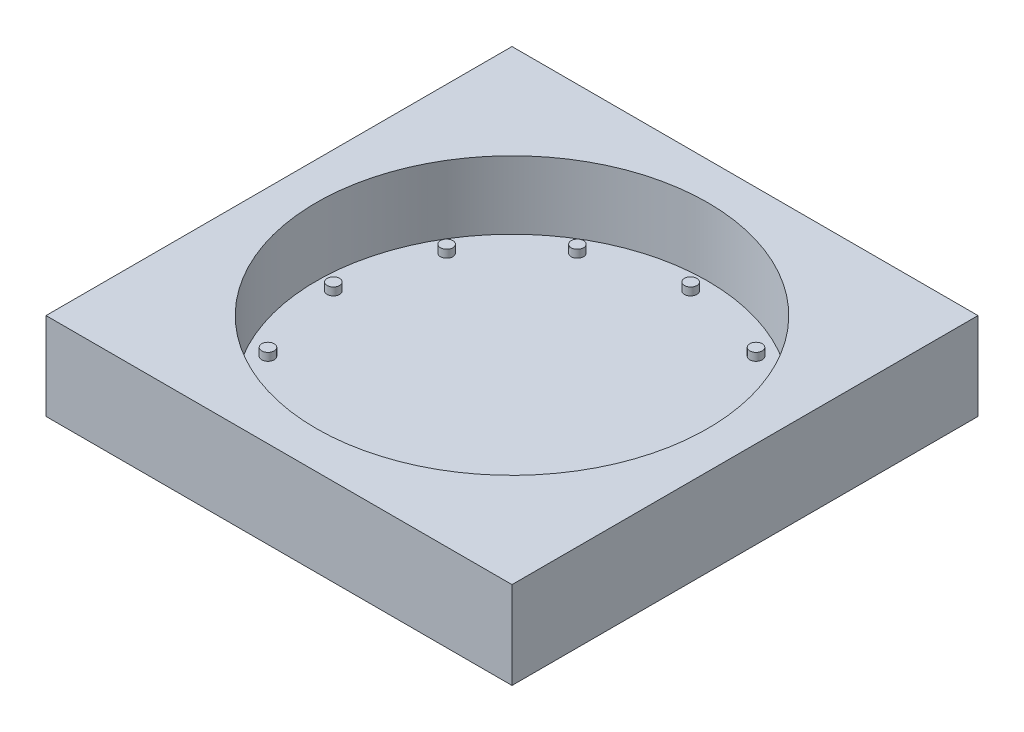
ISO-10303-21;
HEADER;
FILE_DESCRIPTION(('STEP AP214'),'2;1');
FILE_NAME('part.step','',(''),(''),'','','');
FILE_SCHEMA(('AUTOMOTIVE_DESIGN { 1 0 10303 214 1 1 1 1 }'));
ENDSEC;
DATA;
#1=APPLICATION_CONTEXT('core data for automotive mechanical design processes');
#2=APPLICATION_PROTOCOL_DEFINITION('international standard','automotive_design',2000,#1);
#3=PRODUCT_CONTEXT('',#1,'mechanical');
#4=PRODUCT('Part','Part','',(#3));
#5=PRODUCT_RELATED_PRODUCT_CATEGORY('part','',(#4));
#6=PRODUCT_DEFINITION_FORMATION('','',#4);
#7=PRODUCT_DEFINITION_CONTEXT('part definition',#1,'design');
#8=PRODUCT_DEFINITION('design','',#6,#7);
#9=PRODUCT_DEFINITION_SHAPE('','',#8);
#10=(LENGTH_UNIT() NAMED_UNIT(*) SI_UNIT(.MILLI.,.METRE.));
#11=(NAMED_UNIT(*) PLANE_ANGLE_UNIT() SI_UNIT($,.RADIAN.));
#12=(NAMED_UNIT(*) SI_UNIT($,.STERADIAN.) SOLID_ANGLE_UNIT());
#13=UNCERTAINTY_MEASURE_WITH_UNIT(LENGTH_MEASURE(1.E-05),#10,'distance_accuracy_value','');
#14=(GEOMETRIC_REPRESENTATION_CONTEXT(3) GLOBAL_UNCERTAINTY_ASSIGNED_CONTEXT((#13)) GLOBAL_UNIT_ASSIGNED_CONTEXT((#10,
#11,#12)) REPRESENTATION_CONTEXT('',''));
#15=CARTESIAN_POINT('',(0.,0.,0.));
#16=DIRECTION('',(0.,0.,1.));
#17=DIRECTION('',(1.,0.,0.));
#18=AXIS2_PLACEMENT_3D('',#15,#16,#17);
#19=CARTESIAN_POINT('',(0.,22.225,0.));
#20=DIRECTION('',(0.,-1.,0.));
#21=DIRECTION('',(0.,0.,-1.));
#22=AXIS2_PLACEMENT_3D('',#19,#20,#21);
#23=PLANE('',#22);
#24=DIRECTION('',(0.,0.,-1.));
#25=VECTOR('',#24,1.);
#26=CARTESIAN_POINT('',(76.2,22.225,76.2));
#27=LINE('',#26,#25);
#28=CARTESIAN_POINT('',(76.2,22.225,76.2));
#29=VERTEX_POINT('',#28);
#30=CARTESIAN_POINT('',(76.2,22.225,-76.2));
#31=VERTEX_POINT('',#30);
#32=EDGE_CURVE('E123',#29,#31,#27,.T.);
#33=ORIENTED_EDGE('',*,*,#32,.T.);
#34=DIRECTION('',(-1.,0.,0.));
#35=VECTOR('',#34,1.);
#36=CARTESIAN_POINT('',(-76.2,22.225,-76.2));
#37=LINE('',#36,#35);
#38=CARTESIAN_POINT('',(-76.2,22.225,-76.2));
#39=VERTEX_POINT('',#38);
#40=EDGE_CURVE('E129',#31,#39,#37,.T.);
#41=ORIENTED_EDGE('',*,*,#40,.T.);
#42=DIRECTION('',(0.,0.,1.));
#43=VECTOR('',#42,1.);
#44=CARTESIAN_POINT('',(-76.2,22.225,76.2));
#45=LINE('',#44,#43);
#46=CARTESIAN_POINT('',(-76.2,22.225,76.2));
#47=VERTEX_POINT('',#46);
#48=EDGE_CURVE('E60',#39,#47,#45,.T.);
#49=ORIENTED_EDGE('',*,*,#48,.T.);
#50=DIRECTION('',(1.,0.,0.));
#51=VECTOR('',#50,1.);
#52=CARTESIAN_POINT('',(-76.2,22.225,76.2));
#53=LINE('',#52,#51);
#54=EDGE_CURVE('E55',#47,#29,#53,.T.);
#55=ORIENTED_EDGE('',*,*,#54,.T.);
#56=EDGE_LOOP('',(#33,#41,#49,#55));
#57=FACE_BOUND('',#56,.T.);
#58=CARTESIAN_POINT('',(0.,22.225,0.));
#59=DIRECTION('',(0.,1.,0.));
#60=DIRECTION('',(0.,0.,1.));
#61=AXIS2_PLACEMENT_3D('',#58,#59,#60);
#62=CIRCLE('',#61,64.008);
#63=CARTESIAN_POINT('',(0.,22.225,64.008));
#64=VERTEX_POINT('',#63);
#65=EDGE_CURVE('E119',#64,#64,#62,.T.);
#66=ORIENTED_EDGE('',*,*,#65,.F.);
#67=EDGE_LOOP('',(#66));
#68=FACE_BOUND('',#67,.T.);
#69=ADVANCED_FACE('F39',(#57,#68),#23,.F.);
#70=CARTESIAN_POINT('',(76.2,22.225,76.2));
#71=DIRECTION('',(-1.,0.,0.));
#72=DIRECTION('',(0.,0.,1.));
#73=AXIS2_PLACEMENT_3D('',#70,#71,#72);
#74=PLANE('',#73);
#75=DIRECTION('',(0.,-1.,0.));
#76=VECTOR('',#75,1.);
#77=CARTESIAN_POINT('',(76.2,22.225,76.2));
#78=LINE('',#77,#76);
#79=CARTESIAN_POINT('',(76.2,-6.35,76.2));
#80=VERTEX_POINT('',#79);
#81=EDGE_CURVE('E136',#29,#80,#78,.T.);
#82=ORIENTED_EDGE('',*,*,#81,.T.);
#83=DIRECTION('',(0.,0.,1.));
#84=VECTOR('',#83,1.);
#85=CARTESIAN_POINT('',(76.2,-6.35,76.2));
#86=LINE('',#85,#84);
#87=CARTESIAN_POINT('',(76.2,-6.35,-76.2));
#88=VERTEX_POINT('',#87);
#89=EDGE_CURVE('E99',#88,#80,#86,.T.);
#90=ORIENTED_EDGE('',*,*,#89,.F.);
#91=DIRECTION('',(0.,-1.,0.));
#92=VECTOR('',#91,1.);
#93=CARTESIAN_POINT('',(76.2,22.225,-76.2));
#94=LINE('',#93,#92);
#95=EDGE_CURVE('E88',#31,#88,#94,.T.);
#96=ORIENTED_EDGE('',*,*,#95,.F.);
#97=ORIENTED_EDGE('',*,*,#32,.F.);
#98=EDGE_LOOP('',(#82,#90,#96,#97));
#99=FACE_BOUND('',#98,.T.);
#100=ADVANCED_FACE('F41',(#99),#74,.F.);
#101=CARTESIAN_POINT('',(-76.2,22.225,-76.2));
#102=DIRECTION('',(0.,0.,1.));
#103=DIRECTION('',(1.,0.,0.));
#104=AXIS2_PLACEMENT_3D('',#101,#102,#103);
#105=PLANE('',#104);
#106=ORIENTED_EDGE('',*,*,#95,.T.);
#107=DIRECTION('',(1.,0.,0.));
#108=VECTOR('',#107,1.);
#109=CARTESIAN_POINT('',(-76.2,-6.35,-76.2));
#110=LINE('',#109,#108);
#111=CARTESIAN_POINT('',(-76.2,-6.35,-76.2));
#112=VERTEX_POINT('',#111);
#113=EDGE_CURVE('E92',#112,#88,#110,.T.);
#114=ORIENTED_EDGE('',*,*,#113,.F.);
#115=DIRECTION('',(0.,-1.,0.));
#116=VECTOR('',#115,1.);
#117=CARTESIAN_POINT('',(-76.2,22.225,-76.2));
#118=LINE('',#117,#116);
#119=EDGE_CURVE('E81',#39,#112,#118,.T.);
#120=ORIENTED_EDGE('',*,*,#119,.F.);
#121=ORIENTED_EDGE('',*,*,#40,.F.);
#122=EDGE_LOOP('',(#106,#114,#120,#121));
#123=FACE_BOUND('',#122,.T.);
#124=ADVANCED_FACE('F93',(#123),#105,.F.);
#125=CARTESIAN_POINT('',(-76.2,22.225,76.2));
#126=DIRECTION('',(1.,0.,0.));
#127=DIRECTION('',(0.,0.,-1.));
#128=AXIS2_PLACEMENT_3D('',#125,#126,#127);
#129=PLANE('',#128);
#130=ORIENTED_EDGE('',*,*,#119,.T.);
#131=DIRECTION('',(0.,0.,-1.));
#132=VECTOR('',#131,1.);
#133=CARTESIAN_POINT('',(-76.2,-6.35,76.2));
#134=LINE('',#133,#132);
#135=CARTESIAN_POINT('',(-76.2,-6.35,76.2));
#136=VERTEX_POINT('',#135);
#137=EDGE_CURVE('E85',#136,#112,#134,.T.);
#138=ORIENTED_EDGE('',*,*,#137,.F.);
#139=DIRECTION('',(0.,-1.,0.));
#140=VECTOR('',#139,1.);
#141=CARTESIAN_POINT('',(-76.2,22.225,76.2));
#142=LINE('',#141,#140);
#143=EDGE_CURVE('E89',#47,#136,#142,.T.);
#144=ORIENTED_EDGE('',*,*,#143,.F.);
#145=ORIENTED_EDGE('',*,*,#48,.F.);
#146=EDGE_LOOP('',(#130,#138,#144,#145));
#147=FACE_BOUND('',#146,.T.);
#148=ADVANCED_FACE('F83',(#147),#129,.F.);
#149=CARTESIAN_POINT('',(-76.2,22.225,76.2));
#150=DIRECTION('',(0.,0.,-1.));
#151=DIRECTION('',(-1.,0.,0.));
#152=AXIS2_PLACEMENT_3D('',#149,#150,#151);
#153=PLANE('',#152);
#154=ORIENTED_EDGE('',*,*,#143,.T.);
#155=DIRECTION('',(-1.,0.,0.));
#156=VECTOR('',#155,1.);
#157=CARTESIAN_POINT('',(-76.2,-6.35,76.2));
#158=LINE('',#157,#156);
#159=EDGE_CURVE('E104',#80,#136,#158,.T.);
#160=ORIENTED_EDGE('',*,*,#159,.F.);
#161=ORIENTED_EDGE('',*,*,#81,.F.);
#162=ORIENTED_EDGE('',*,*,#54,.F.);
#163=EDGE_LOOP('',(#154,#160,#161,#162));
#164=FACE_BOUND('',#163,.T.);
#165=ADVANCED_FACE('F217',(#164),#153,.F.);
#166=CARTESIAN_POINT('',(0.,22.225,0.));
#167=DIRECTION('',(0.,-1.,0.));
#168=DIRECTION('',(0.,0.,-1.));
#169=AXIS2_PLACEMENT_3D('',#166,#167,#168);
#170=CYLINDRICAL_SURFACE('',#169,64.008);
#171=ORIENTED_EDGE('',*,*,#65,.T.);
#172=EDGE_LOOP('',(#171));
#173=FACE_BOUND('',#172,.T.);
#174=CARTESIAN_POINT('',(0.,0.,0.));
#175=DIRECTION('',(0.,1.,0.));
#176=DIRECTION('',(0.,0.,1.));
#177=AXIS2_PLACEMENT_3D('',#174,#175,#176);
#178=CIRCLE('',#177,64.008);
#179=CARTESIAN_POINT('',(0.,0.,64.008));
#180=VERTEX_POINT('',#179);
#181=EDGE_CURVE('E118',#180,#180,#178,.T.);
#182=ORIENTED_EDGE('',*,*,#181,.F.);
#183=EDGE_LOOP('',(#182));
#184=FACE_BOUND('',#183,.T.);
#185=ADVANCED_FACE('F191',(#173,#184),#170,.F.);
#186=CARTESIAN_POINT('',(0.,0.,0.));
#187=DIRECTION('',(0.,-1.,0.));
#188=DIRECTION('',(0.,0.,-1.));
#189=AXIS2_PLACEMENT_3D('',#186,#187,#188);
#190=PLANE('',#189);
#191=CARTESIAN_POINT('',(-50.5932040890873,0.,-29.2099999999993));
#192=DIRECTION('',(0.,-1.,0.));
#193=DIRECTION('',(0.,0.,-1.));
#194=AXIS2_PLACEMENT_3D('',#191,#192,#193);
#195=CIRCLE('',#194,2.032);
#196=CARTESIAN_POINT('',(-50.5932040890873,0.,-31.2419999999993));
#197=VERTEX_POINT('',#196);
#198=EDGE_CURVE('E11',#197,#197,#195,.F.);
#199=ORIENTED_EDGE('',*,*,#198,.F.);
#200=EDGE_LOOP('',(#199));
#201=FACE_BOUND('',#200,.T.);
#202=CARTESIAN_POINT('',(-29.2100000000006,0.,-50.5932040890866));
#203=DIRECTION('',(0.,-1.,0.));
#204=DIRECTION('',(0.,0.,-1.));
#205=AXIS2_PLACEMENT_3D('',#202,#203,#204);
#206=CIRCLE('',#205,2.032);
#207=CARTESIAN_POINT('',(-29.2100000000006,0.,-52.6252040890866));
#208=VERTEX_POINT('',#207);
#209=EDGE_CURVE('E48',#208,#208,#206,.F.);
#210=ORIENTED_EDGE('',*,*,#209,.F.);
#211=EDGE_LOOP('',(#210));
#212=FACE_BOUND('',#211,.T.);
#213=CARTESIAN_POINT('',(-6.11917019445647E-13,0.,-58.42));
#214=DIRECTION('',(0.,-1.,0.));
#215=DIRECTION('',(0.,0.,-1.));
#216=AXIS2_PLACEMENT_3D('',#213,#214,#215);
#217=CIRCLE('',#216,2.032);
#218=CARTESIAN_POINT('',(-6.11917019445647E-13,0.,-60.452));
#219=VERTEX_POINT('',#218);
#220=EDGE_CURVE('E179',#219,#219,#217,.F.);
#221=ORIENTED_EDGE('',*,*,#220,.F.);
#222=EDGE_LOOP('',(#221));
#223=FACE_BOUND('',#222,.T.);
#224=CARTESIAN_POINT('',(29.2099999999995,0.,-50.5932040890872));
#225=DIRECTION('',(0.,-1.,0.));
#226=DIRECTION('',(0.,0.,-1.));
#227=AXIS2_PLACEMENT_3D('',#224,#225,#226);
#228=CIRCLE('',#227,2.032);
#229=CARTESIAN_POINT('',(29.2099999999995,0.,-52.6252040890872));
#230=VERTEX_POINT('',#229);
#231=EDGE_CURVE('E175',#230,#230,#228,.F.);
#232=ORIENTED_EDGE('',*,*,#231,.F.);
#233=EDGE_LOOP('',(#232));
#234=FACE_BOUND('',#233,.T.);
#235=CARTESIAN_POINT('',(50.5932040890867,0.,-29.2100000000004));
#236=DIRECTION('',(0.,-1.,0.));
#237=DIRECTION('',(0.,0.,-1.));
#238=AXIS2_PLACEMENT_3D('',#235,#236,#237);
#239=CIRCLE('',#238,2.032);
#240=CARTESIAN_POINT('',(50.5932040890867,0.,-31.2420000000004));
#241=VERTEX_POINT('',#240);
#242=EDGE_CURVE('E171',#241,#241,#239,.F.);
#243=ORIENTED_EDGE('',*,*,#242,.F.);
#244=EDGE_LOOP('',(#243));
#245=FACE_BOUND('',#244,.T.);
#246=CARTESIAN_POINT('',(58.42,0.,0.));
#247=DIRECTION('',(0.,-1.,0.));
#248=DIRECTION('',(0.,0.,-1.));
#249=AXIS2_PLACEMENT_3D('',#246,#247,#248);
#250=CIRCLE('',#249,2.032);
#251=CARTESIAN_POINT('',(58.42,0.,-2.032));
#252=VERTEX_POINT('',#251);
#253=EDGE_CURVE('E167',#252,#252,#250,.F.);
#254=ORIENTED_EDGE('',*,*,#253,.F.);
#255=EDGE_LOOP('',(#254));
#256=FACE_BOUND('',#255,.T.);
#257=CARTESIAN_POINT('',(50.5932040890871,0.,29.2099999999997));
#258=DIRECTION('',(0.,-1.,0.));
#259=DIRECTION('',(0.,0.,-1.));
#260=AXIS2_PLACEMENT_3D('',#257,#258,#259);
#261=CIRCLE('',#260,2.032);
#262=CARTESIAN_POINT('',(50.5932040890871,0.,27.1779999999997));
#263=VERTEX_POINT('',#262);
#264=EDGE_CURVE('E163',#263,#263,#261,.F.);
#265=ORIENTED_EDGE('',*,*,#264,.F.);
#266=EDGE_LOOP('',(#265));
#267=FACE_BOUND('',#266,.T.);
#268=CARTESIAN_POINT('',(29.2100000000002,0.,50.5932040890868));
#269=DIRECTION('',(0.,-1.,0.));
#270=DIRECTION('',(0.,0.,-1.));
#271=AXIS2_PLACEMENT_3D('',#268,#269,#270);
#272=CIRCLE('',#271,2.032);
#273=CARTESIAN_POINT('',(29.2100000000002,0.,48.5612040890868));
#274=VERTEX_POINT('',#273);
#275=EDGE_CURVE('E159',#274,#274,#272,.F.);
#276=ORIENTED_EDGE('',*,*,#275,.F.);
#277=EDGE_LOOP('',(#276));
#278=FACE_BOUND('',#277,.T.);
#279=CARTESIAN_POINT('',(2.03972339815216E-13,0.,58.42));
#280=DIRECTION('',(0.,-1.,0.));
#281=DIRECTION('',(0.,0.,-1.));
#282=AXIS2_PLACEMENT_3D('',#279,#280,#281);
#283=CIRCLE('',#282,2.032);
#284=CARTESIAN_POINT('',(2.03972339815216E-13,0.,56.388));
#285=VERTEX_POINT('',#284);
#286=EDGE_CURVE('E155',#285,#285,#283,.F.);
#287=ORIENTED_EDGE('',*,*,#286,.F.);
#288=EDGE_LOOP('',(#287));
#289=FACE_BOUND('',#288,.T.);
#290=CARTESIAN_POINT('',(-29.2099999999999,0.,50.593204089087));
#291=DIRECTION('',(0.,-1.,0.));
#292=DIRECTION('',(0.,0.,-1.));
#293=AXIS2_PLACEMENT_3D('',#290,#291,#292);
#294=CIRCLE('',#293,2.032);
#295=CARTESIAN_POINT('',(-29.2099999999999,0.,48.561204089087));
#296=VERTEX_POINT('',#295);
#297=EDGE_CURVE('E151',#296,#296,#294,.F.);
#298=ORIENTED_EDGE('',*,*,#297,.F.);
#299=EDGE_LOOP('',(#298));
#300=FACE_BOUND('',#299,.T.);
#301=CARTESIAN_POINT('',(-50.5932040890869,0.,29.2100000000001));
#302=DIRECTION('',(0.,-1.,0.));
#303=DIRECTION('',(0.,0.,-1.));
#304=AXIS2_PLACEMENT_3D('',#301,#302,#303);
#305=CIRCLE('',#304,2.032);
#306=CARTESIAN_POINT('',(-50.5932040890869,0.,27.1780000000001));
#307=VERTEX_POINT('',#306);
#308=EDGE_CURVE('E147',#307,#307,#305,.F.);
#309=ORIENTED_EDGE('',*,*,#308,.F.);
#310=EDGE_LOOP('',(#309));
#311=FACE_BOUND('',#310,.T.);
#312=CARTESIAN_POINT('',(-58.42,0.,0.));
#313=DIRECTION('',(0.,-1.,0.));
#314=DIRECTION('',(0.,0.,-1.));
#315=AXIS2_PLACEMENT_3D('',#312,#313,#314);
#316=CIRCLE('',#315,2.032);
#317=CARTESIAN_POINT('',(-58.42,0.,-2.032));
#318=VERTEX_POINT('',#317);
#319=EDGE_CURVE('E143',#318,#318,#316,.F.);
#320=ORIENTED_EDGE('',*,*,#319,.F.);
#321=EDGE_LOOP('',(#320));
#322=FACE_BOUND('',#321,.T.);
#323=ORIENTED_EDGE('',*,*,#181,.T.);
#324=EDGE_LOOP('',(#323));
#325=FACE_BOUND('',#324,.T.);
#326=ADVANCED_FACE('F188',(#201,#212,#223,#234,#245,#256,#267,#278,#289,#300,#311,#322,#325),
#190,.F.);
#327=CARTESIAN_POINT('',(0.,-6.35,0.));
#328=DIRECTION('',(0.,-1.,0.));
#329=DIRECTION('',(0.,0.,-1.));
#330=AXIS2_PLACEMENT_3D('',#327,#328,#329);
#331=PLANE('',#330);
#332=ORIENTED_EDGE('',*,*,#137,.T.);
#333=ORIENTED_EDGE('',*,*,#113,.T.);
#334=ORIENTED_EDGE('',*,*,#89,.T.);
#335=ORIENTED_EDGE('',*,*,#159,.T.);
#336=EDGE_LOOP('',(#332,#333,#334,#335));
#337=FACE_BOUND('',#336,.T.);
#338=ADVANCED_FACE('F102',(#337),#331,.T.);
#339=CARTESIAN_POINT('',(-58.42,2.54,0.));
#340=DIRECTION('',(0.,-1.,0.));
#341=DIRECTION('',(0.,0.,-1.));
#342=AXIS2_PLACEMENT_3D('',#339,#340,#341);
#343=CYLINDRICAL_SURFACE('',#342,2.032);
#344=CARTESIAN_POINT('',(-58.42,2.54,0.));
#345=DIRECTION('',(0.,1.,0.));
#346=DIRECTION('',(0.,0.,1.));
#347=AXIS2_PLACEMENT_3D('',#344,#345,#346);
#348=CIRCLE('',#347,2.032);
#349=CARTESIAN_POINT('',(-58.42,2.54,2.032));
#350=VERTEX_POINT('',#349);
#351=EDGE_CURVE('E106',#350,#350,#348,.T.);
#352=ORIENTED_EDGE('',*,*,#351,.F.);
#353=EDGE_LOOP('',(#352));
#354=FACE_BOUND('',#353,.T.);
#355=ORIENTED_EDGE('',*,*,#319,.T.);
#356=EDGE_LOOP('',(#355));
#357=FACE_BOUND('',#356,.T.);
#358=ADVANCED_FACE('F258',(#354,#357),#343,.T.);
#359=CARTESIAN_POINT('',(-58.42,2.54,0.));
#360=DIRECTION('',(0.,1.,0.));
#361=DIRECTION('',(0.,0.,1.));
#362=AXIS2_PLACEMENT_3D('',#359,#360,#361);
#363=PLANE('',#362);
#364=ORIENTED_EDGE('',*,*,#351,.T.);
#365=EDGE_LOOP('',(#364));
#366=FACE_BOUND('',#365,.T.);
#367=ADVANCED_FACE('F267',(#366),#363,.T.);
#368=CARTESIAN_POINT('',(-50.5932040890869,2.54,29.2100000000001));
#369=DIRECTION('',(0.,-1.,0.));
#370=DIRECTION('',(0.,0.,-1.));
#371=AXIS2_PLACEMENT_3D('',#368,#369,#370);
#372=CYLINDRICAL_SURFACE('',#371,2.032);
#373=CARTESIAN_POINT('',(-50.5932040890869,2.54,29.2100000000001));
#374=DIRECTION('',(0.,1.,0.));
#375=DIRECTION('',(0.500000000000001,0.,0.866025403784438));
#376=AXIS2_PLACEMENT_3D('',#373,#374,#375);
#377=CIRCLE('',#376,2.032);
#378=CARTESIAN_POINT('',(-49.5772040890869,2.54,30.96976362049));
#379=VERTEX_POINT('',#378);
#380=EDGE_CURVE('E110',#379,#379,#377,.T.);
#381=ORIENTED_EDGE('',*,*,#380,.F.);
#382=EDGE_LOOP('',(#381));
#383=FACE_BOUND('',#382,.T.);
#384=ORIENTED_EDGE('',*,*,#308,.T.);
#385=EDGE_LOOP('',(#384));
#386=FACE_BOUND('',#385,.T.);
#387=ADVANCED_FACE('F277',(#383,#386),#372,.T.);
#388=CARTESIAN_POINT('',(-50.5932040890869,2.54,29.2100000000001));
#389=DIRECTION('',(0.,1.,0.));
#390=DIRECTION('',(0.500000000000001,0.,0.866025403784438));
#391=AXIS2_PLACEMENT_3D('',#388,#389,#390);
#392=PLANE('',#391);
#393=ORIENTED_EDGE('',*,*,#380,.T.);
#394=EDGE_LOOP('',(#393));
#395=FACE_BOUND('',#394,.T.);
#396=ADVANCED_FACE('F292',(#395),#392,.T.);
#397=CARTESIAN_POINT('',(-29.2099999999999,2.54,50.593204089087));
#398=DIRECTION('',(0.,-1.,0.));
#399=DIRECTION('',(0.,0.,-1.));
#400=AXIS2_PLACEMENT_3D('',#397,#398,#399);
#401=CYLINDRICAL_SURFACE('',#400,2.032);
#402=CARTESIAN_POINT('',(-29.2099999999999,2.54,50.593204089087));
#403=DIRECTION('',(0.,1.,0.));
#404=DIRECTION('',(0.86602540378444,0.,0.499999999999998));
#405=AXIS2_PLACEMENT_3D('',#402,#403,#404);
#406=CIRCLE('',#405,2.032);
#407=CARTESIAN_POINT('',(-27.4502363795099,2.54,51.609204089087));
#408=VERTEX_POINT('',#407);
#409=EDGE_CURVE('E543',#408,#408,#406,.T.);
#410=ORIENTED_EDGE('',*,*,#409,.F.);
#411=EDGE_LOOP('',(#410));
#412=FACE_BOUND('',#411,.T.);
#413=ORIENTED_EDGE('',*,*,#297,.T.);
#414=EDGE_LOOP('',(#413));
#415=FACE_BOUND('',#414,.T.);
#416=ADVANCED_FACE('F302',(#412,#415),#401,.T.);
#417=CARTESIAN_POINT('',(-29.2099999999999,2.54,50.593204089087));
#418=DIRECTION('',(0.,1.,0.));
#419=DIRECTION('',(0.86602540378444,0.,0.499999999999998));
#420=AXIS2_PLACEMENT_3D('',#417,#418,#419);
#421=PLANE('',#420);
#422=ORIENTED_EDGE('',*,*,#409,.T.);
#423=EDGE_LOOP('',(#422));
#424=FACE_BOUND('',#423,.T.);
#425=ADVANCED_FACE('F312',(#424),#421,.T.);
#426=CARTESIAN_POINT('',(2.03972339815216E-13,2.54,58.42));
#427=DIRECTION('',(0.,-1.,0.));
#428=DIRECTION('',(0.,0.,-1.));
#429=AXIS2_PLACEMENT_3D('',#426,#427,#428);
#430=CYLINDRICAL_SURFACE('',#429,2.032);
#431=CARTESIAN_POINT('',(2.03972339815216E-13,2.54,58.42));
#432=DIRECTION('',(0.,1.,0.));
#433=DIRECTION('',(1.,0.,0.));
#434=AXIS2_PLACEMENT_3D('',#431,#432,#433);
#435=CIRCLE('',#434,2.032);
#436=CARTESIAN_POINT('',(2.0320000000002,2.54,58.42));
#437=VERTEX_POINT('',#436);
#438=EDGE_CURVE('E539',#437,#437,#435,.T.);
#439=ORIENTED_EDGE('',*,*,#438,.F.);
#440=EDGE_LOOP('',(#439));
#441=FACE_BOUND('',#440,.T.);
#442=ORIENTED_EDGE('',*,*,#286,.T.);
#443=EDGE_LOOP('',(#442));
#444=FACE_BOUND('',#443,.T.);
#445=ADVANCED_FACE('F322',(#441,#444),#430,.T.);
#446=CARTESIAN_POINT('',(2.03972339815216E-13,2.54,58.42));
#447=DIRECTION('',(0.,1.,0.));
#448=DIRECTION('',(1.,0.,0.));
#449=AXIS2_PLACEMENT_3D('',#446,#447,#448);
#450=PLANE('',#449);
#451=ORIENTED_EDGE('',*,*,#438,.T.);
#452=EDGE_LOOP('',(#451));
#453=FACE_BOUND('',#452,.T.);
#454=ADVANCED_FACE('F332',(#453),#450,.T.);
#455=CARTESIAN_POINT('',(29.2100000000002,2.54,50.5932040890868));
#456=DIRECTION('',(0.,-1.,0.));
#457=DIRECTION('',(0.,0.,-1.));
#458=AXIS2_PLACEMENT_3D('',#455,#456,#457);
#459=CYLINDRICAL_SURFACE('',#458,2.032);
#460=CARTESIAN_POINT('',(29.2100000000002,2.54,50.5932040890868));
#461=DIRECTION('',(0.,1.,0.));
#462=DIRECTION('',(0.866025403784436,0.,-0.500000000000004));
#463=AXIS2_PLACEMENT_3D('',#460,#461,#462);
#464=CIRCLE('',#463,2.032);
#465=CARTESIAN_POINT('',(30.9697636204902,2.54,49.5772040890868));
#466=VERTEX_POINT('',#465);
#467=EDGE_CURVE('E535',#466,#466,#464,.T.);
#468=ORIENTED_EDGE('',*,*,#467,.F.);
#469=EDGE_LOOP('',(#468));
#470=FACE_BOUND('',#469,.T.);
#471=ORIENTED_EDGE('',*,*,#275,.T.);
#472=EDGE_LOOP('',(#471));
#473=FACE_BOUND('',#472,.T.);
#474=ADVANCED_FACE('F342',(#470,#473),#459,.T.);
#475=CARTESIAN_POINT('',(29.2100000000002,2.54,50.5932040890868));
#476=DIRECTION('',(0.,1.,0.));
#477=DIRECTION('',(0.866025403784436,0.,-0.500000000000004));
#478=AXIS2_PLACEMENT_3D('',#475,#476,#477);
#479=PLANE('',#478);
#480=ORIENTED_EDGE('',*,*,#467,.T.);
#481=EDGE_LOOP('',(#480));
#482=FACE_BOUND('',#481,.T.);
#483=ADVANCED_FACE('F352',(#482),#479,.T.);
#484=CARTESIAN_POINT('',(50.5932040890871,2.54,29.2099999999997));
#485=DIRECTION('',(0.,-1.,0.));
#486=DIRECTION('',(0.,0.,-1.));
#487=AXIS2_PLACEMENT_3D('',#484,#485,#486);
#488=CYLINDRICAL_SURFACE('',#487,2.032);
#489=CARTESIAN_POINT('',(50.5932040890871,2.54,29.2099999999997));
#490=DIRECTION('',(0.,1.,0.));
#491=DIRECTION('',(0.499999999999995,0.,-0.866025403784442));
#492=AXIS2_PLACEMENT_3D('',#489,#490,#491);
#493=CIRCLE('',#492,2.032);
#494=CARTESIAN_POINT('',(51.6092040890871,2.54,27.4502363795097));
#495=VERTEX_POINT('',#494);
#496=EDGE_CURVE('E531',#495,#495,#493,.T.);
#497=ORIENTED_EDGE('',*,*,#496,.F.);
#498=EDGE_LOOP('',(#497));
#499=FACE_BOUND('',#498,.T.);
#500=ORIENTED_EDGE('',*,*,#264,.T.);
#501=EDGE_LOOP('',(#500));
#502=FACE_BOUND('',#501,.T.);
#503=ADVANCED_FACE('F362',(#499,#502),#488,.T.);
#504=CARTESIAN_POINT('',(50.5932040890871,2.54,29.2099999999997));
#505=DIRECTION('',(0.,1.,0.));
#506=DIRECTION('',(0.499999999999995,0.,-0.866025403784442));
#507=AXIS2_PLACEMENT_3D('',#504,#505,#506);
#508=PLANE('',#507);
#509=ORIENTED_EDGE('',*,*,#496,.T.);
#510=EDGE_LOOP('',(#509));
#511=FACE_BOUND('',#510,.T.);
#512=ADVANCED_FACE('F372',(#511),#508,.T.);
#513=CARTESIAN_POINT('',(58.42,2.54,0.));
#514=DIRECTION('',(0.,-1.,0.));
#515=DIRECTION('',(0.,0.,-1.));
#516=AXIS2_PLACEMENT_3D('',#513,#514,#515);
#517=CYLINDRICAL_SURFACE('',#516,2.032);
#518=CARTESIAN_POINT('',(58.42,2.54,0.));
#519=DIRECTION('',(0.,1.,0.));
#520=DIRECTION('',(0.,0.,-1.));
#521=AXIS2_PLACEMENT_3D('',#518,#519,#520);
#522=CIRCLE('',#521,2.032);
#523=CARTESIAN_POINT('',(58.42,2.54,-2.032));
#524=VERTEX_POINT('',#523);
#525=EDGE_CURVE('E527',#524,#524,#522,.T.);
#526=ORIENTED_EDGE('',*,*,#525,.F.);
#527=EDGE_LOOP('',(#526));
#528=FACE_BOUND('',#527,.T.);
#529=ORIENTED_EDGE('',*,*,#253,.T.);
#530=EDGE_LOOP('',(#529));
#531=FACE_BOUND('',#530,.T.);
#532=ADVANCED_FACE('F382',(#528,#531),#517,.T.);
#533=CARTESIAN_POINT('',(58.42,2.54,0.));
#534=DIRECTION('',(0.,1.,0.));
#535=DIRECTION('',(0.,0.,-1.));
#536=AXIS2_PLACEMENT_3D('',#533,#534,#535);
#537=PLANE('',#536);
#538=ORIENTED_EDGE('',*,*,#525,.T.);
#539=EDGE_LOOP('',(#538));
#540=FACE_BOUND('',#539,.T.);
#541=ADVANCED_FACE('F392',(#540),#537,.T.);
#542=CARTESIAN_POINT('',(50.5932040890867,2.54,-29.2100000000004));
#543=DIRECTION('',(0.,-1.,0.));
#544=DIRECTION('',(0.,0.,-1.));
#545=AXIS2_PLACEMENT_3D('',#542,#543,#544);
#546=CYLINDRICAL_SURFACE('',#545,2.032);
#547=CARTESIAN_POINT('',(50.5932040890867,2.54,-29.2100000000004));
#548=DIRECTION('',(0.,1.,0.));
#549=DIRECTION('',(-0.500000000000007,0.,-0.866025403784435));
#550=AXIS2_PLACEMENT_3D('',#547,#548,#549);
#551=CIRCLE('',#550,2.032);
#552=CARTESIAN_POINT('',(49.5772040890866,2.54,-30.9697636204904));
#553=VERTEX_POINT('',#552);
#554=EDGE_CURVE('E523',#553,#553,#551,.T.);
#555=ORIENTED_EDGE('',*,*,#554,.F.);
#556=EDGE_LOOP('',(#555));
#557=FACE_BOUND('',#556,.T.);
#558=ORIENTED_EDGE('',*,*,#242,.T.);
#559=EDGE_LOOP('',(#558));
#560=FACE_BOUND('',#559,.T.);
#561=ADVANCED_FACE('F402',(#557,#560),#546,.T.);
#562=CARTESIAN_POINT('',(50.5932040890867,2.54,-29.2100000000004));
#563=DIRECTION('',(0.,1.,0.));
#564=DIRECTION('',(-0.500000000000007,0.,-0.866025403784435));
#565=AXIS2_PLACEMENT_3D('',#562,#563,#564);
#566=PLANE('',#565);
#567=ORIENTED_EDGE('',*,*,#554,.T.);
#568=EDGE_LOOP('',(#567));
#569=FACE_BOUND('',#568,.T.);
#570=ADVANCED_FACE('F412',(#569),#566,.T.);
#571=CARTESIAN_POINT('',(29.2099999999995,2.54,-50.5932040890872));
#572=DIRECTION('',(0.,-1.,0.));
#573=DIRECTION('',(0.,0.,-1.));
#574=AXIS2_PLACEMENT_3D('',#571,#572,#573);
#575=CYLINDRICAL_SURFACE('',#574,2.032);
#576=CARTESIAN_POINT('',(29.2099999999995,2.54,-50.5932040890872));
#577=DIRECTION('',(0.,1.,0.));
#578=DIRECTION('',(-0.866025403784443,0.,-0.499999999999992));
#579=AXIS2_PLACEMENT_3D('',#576,#577,#578);
#580=CIRCLE('',#579,2.032);
#581=CARTESIAN_POINT('',(27.4502363795095,2.54,-51.6092040890872));
#582=VERTEX_POINT('',#581);
#583=EDGE_CURVE('E519',#582,#582,#580,.T.);
#584=ORIENTED_EDGE('',*,*,#583,.F.);
#585=EDGE_LOOP('',(#584));
#586=FACE_BOUND('',#585,.T.);
#587=ORIENTED_EDGE('',*,*,#231,.T.);
#588=EDGE_LOOP('',(#587));
#589=FACE_BOUND('',#588,.T.);
#590=ADVANCED_FACE('F422',(#586,#589),#575,.T.);
#591=CARTESIAN_POINT('',(29.2099999999995,2.54,-50.5932040890872));
#592=DIRECTION('',(0.,1.,0.));
#593=DIRECTION('',(-0.866025403784443,0.,-0.499999999999992));
#594=AXIS2_PLACEMENT_3D('',#591,#592,#593);
#595=PLANE('',#594);
#596=ORIENTED_EDGE('',*,*,#583,.T.);
#597=EDGE_LOOP('',(#596));
#598=FACE_BOUND('',#597,.T.);
#599=ADVANCED_FACE('F432',(#598),#595,.T.);
#600=CARTESIAN_POINT('',(-6.11917019445647E-13,2.54,-58.42));
#601=DIRECTION('',(0.,-1.,0.));
#602=DIRECTION('',(0.,0.,-1.));
#603=AXIS2_PLACEMENT_3D('',#600,#601,#602);
#604=CYLINDRICAL_SURFACE('',#603,2.032);
#605=CARTESIAN_POINT('',(-6.11917019445647E-13,2.54,-58.42));
#606=DIRECTION('',(0.,1.,0.));
#607=DIRECTION('',(-1.,0.,0.));
#608=AXIS2_PLACEMENT_3D('',#605,#606,#607);
#609=CIRCLE('',#608,2.032);
#610=CARTESIAN_POINT('',(-2.03200000000061,2.54,-58.42));
#611=VERTEX_POINT('',#610);
#612=EDGE_CURVE('E513',#611,#611,#609,.T.);
#613=ORIENTED_EDGE('',*,*,#612,.F.);
#614=EDGE_LOOP('',(#613));
#615=FACE_BOUND('',#614,.T.);
#616=ORIENTED_EDGE('',*,*,#220,.T.);
#617=EDGE_LOOP('',(#616));
#618=FACE_BOUND('',#617,.T.);
#619=ADVANCED_FACE('F442',(#615,#618),#604,.T.);
#620=CARTESIAN_POINT('',(-6.11917019445647E-13,2.54,-58.42));
#621=DIRECTION('',(0.,1.,0.));
#622=DIRECTION('',(-1.,0.,0.));
#623=AXIS2_PLACEMENT_3D('',#620,#621,#622);
#624=PLANE('',#623);
#625=ORIENTED_EDGE('',*,*,#612,.T.);
#626=EDGE_LOOP('',(#625));
#627=FACE_BOUND('',#626,.T.);
#628=ADVANCED_FACE('F452',(#627),#624,.T.);
#629=CARTESIAN_POINT('',(-29.2100000000006,2.54,-50.5932040890866));
#630=DIRECTION('',(0.,-1.,0.));
#631=DIRECTION('',(0.,0.,-1.));
#632=AXIS2_PLACEMENT_3D('',#629,#630,#631);
#633=CYLINDRICAL_SURFACE('',#632,2.032);
#634=CARTESIAN_POINT('',(-29.2100000000006,2.54,-50.5932040890866));
#635=DIRECTION('',(0.,1.,0.));
#636=DIRECTION('',(-0.866025403784433,0.,0.50000000000001));
#637=AXIS2_PLACEMENT_3D('',#634,#635,#636);
#638=CIRCLE('',#637,2.032);
#639=CARTESIAN_POINT('',(-30.9697636204906,2.54,-49.5772040890865));
#640=VERTEX_POINT('',#639);
#641=EDGE_CURVE('E509',#640,#640,#638,.T.);
#642=ORIENTED_EDGE('',*,*,#641,.F.);
#643=EDGE_LOOP('',(#642));
#644=FACE_BOUND('',#643,.T.);
#645=ORIENTED_EDGE('',*,*,#209,.T.);
#646=EDGE_LOOP('',(#645));
#647=FACE_BOUND('',#646,.T.);
#648=ADVANCED_FACE('F186',(#644,#647),#633,.T.);
#649=CARTESIAN_POINT('',(-29.2100000000006,2.54,-50.5932040890866));
#650=DIRECTION('',(0.,1.,0.));
#651=DIRECTION('',(-0.866025403784433,0.,0.50000000000001));
#652=AXIS2_PLACEMENT_3D('',#649,#650,#651);
#653=PLANE('',#652);
#654=ORIENTED_EDGE('',*,*,#641,.T.);
#655=EDGE_LOOP('',(#654));
#656=FACE_BOUND('',#655,.T.);
#657=ADVANCED_FACE('F471',(#656),#653,.T.);
#658=CARTESIAN_POINT('',(-50.5932040890873,2.54,-29.2099999999993));
#659=DIRECTION('',(0.,-1.,0.));
#660=DIRECTION('',(0.,0.,-1.));
#661=AXIS2_PLACEMENT_3D('',#658,#659,#660);
#662=CYLINDRICAL_SURFACE('',#661,2.032);
#663=CARTESIAN_POINT('',(-50.5932040890873,2.54,-29.2099999999993));
#664=DIRECTION('',(0.,1.,0.));
#665=DIRECTION('',(-0.499999999999989,0.,0.866025403784445));
#666=AXIS2_PLACEMENT_3D('',#663,#664,#665);
#667=CIRCLE('',#666,2.032);
#668=CARTESIAN_POINT('',(-51.6092040890872,2.54,-27.4502363795094));
#669=VERTEX_POINT('',#668);
#670=EDGE_CURVE('E507',#669,#669,#667,.T.);
#671=ORIENTED_EDGE('',*,*,#670,.F.);
#672=EDGE_LOOP('',(#671));
#673=FACE_BOUND('',#672,.T.);
#674=ORIENTED_EDGE('',*,*,#198,.T.);
#675=EDGE_LOOP('',(#674));
#676=FACE_BOUND('',#675,.T.);
#677=ADVANCED_FACE('F481',(#673,#676),#662,.T.);
#678=CARTESIAN_POINT('',(-50.5932040890873,2.54,-29.2099999999993));
#679=DIRECTION('',(0.,1.,0.));
#680=DIRECTION('',(-0.499999999999989,0.,0.866025403784445));
#681=AXIS2_PLACEMENT_3D('',#678,#679,#680);
#682=PLANE('',#681);
#683=ORIENTED_EDGE('',*,*,#670,.T.);
#684=EDGE_LOOP('',(#683));
#685=FACE_BOUND('',#684,.T.);
#686=ADVANCED_FACE('F491',(#685),#682,.T.);
#687=CLOSED_SHELL('',(#69,#100,#124,#148,#165,#185,#326,#338,#358,#367,#387,#396,#416,#425,#445,
#454,#474,#483,#503,#512,#532,#541,#561,#570,#590,#599,#619,#628,#648,#657,#677,#686));
#688=MANIFOLD_SOLID_BREP('B2',#687);
#689=ADVANCED_BREP_SHAPE_REPRESENTATION('',(#18,#688),#14);
#690=SHAPE_DEFINITION_REPRESENTATION(#9,#689);
ENDSEC;
END-ISO-10303-21;
